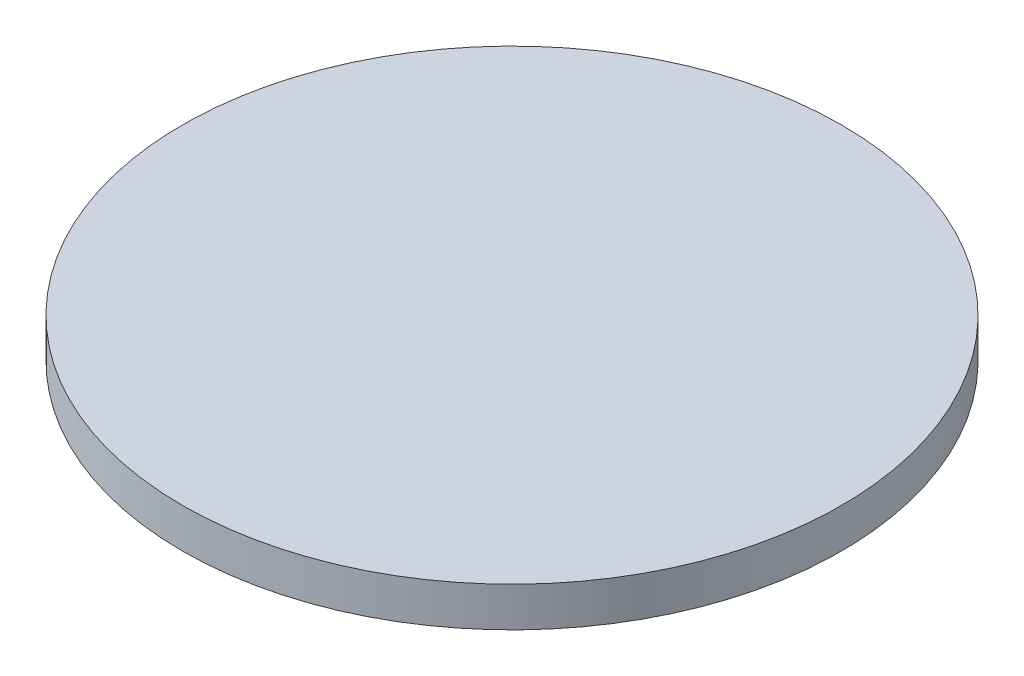
ISO-10303-21;
HEADER;
FILE_DESCRIPTION(('STEP AP214'),'2;1');
FILE_NAME('part.step','',(''),(''),'','','');
FILE_SCHEMA(('AUTOMOTIVE_DESIGN { 1 0 10303 214 1 1 1 1 }'));
ENDSEC;
DATA;
#1=APPLICATION_CONTEXT('core data for automotive mechanical design processes');
#2=APPLICATION_PROTOCOL_DEFINITION('international standard','automotive_design',2000,#1);
#3=PRODUCT_CONTEXT('',#1,'mechanical');
#4=PRODUCT('Part','Part','',(#3));
#5=PRODUCT_RELATED_PRODUCT_CATEGORY('part','',(#4));
#6=PRODUCT_DEFINITION_FORMATION('','',#4);
#7=PRODUCT_DEFINITION_CONTEXT('part definition',#1,'design');
#8=PRODUCT_DEFINITION('design','',#6,#7);
#9=PRODUCT_DEFINITION_SHAPE('','',#8);
#10=(LENGTH_UNIT() NAMED_UNIT(*) SI_UNIT(.MILLI.,.METRE.));
#11=(NAMED_UNIT(*) PLANE_ANGLE_UNIT() SI_UNIT($,.RADIAN.));
#12=(NAMED_UNIT(*) SI_UNIT($,.STERADIAN.) SOLID_ANGLE_UNIT());
#13=UNCERTAINTY_MEASURE_WITH_UNIT(LENGTH_MEASURE(1.E-05),#10,'distance_accuracy_value','');
#14=(GEOMETRIC_REPRESENTATION_CONTEXT(3) GLOBAL_UNCERTAINTY_ASSIGNED_CONTEXT((#13)) GLOBAL_UNIT_ASSIGNED_CONTEXT((#10,
#11,#12)) REPRESENTATION_CONTEXT('',''));
#15=CARTESIAN_POINT('',(0.,0.,0.));
#16=DIRECTION('',(0.,0.,1.));
#17=DIRECTION('',(1.,0.,0.));
#18=AXIS2_PLACEMENT_3D('',#15,#16,#17);
#19=CARTESIAN_POINT('',(0.,3.,0.));
#20=DIRECTION('',(0.,-1.,0.));
#21=DIRECTION('',(0.,0.,-1.));
#22=AXIS2_PLACEMENT_3D('',#19,#20,#21);
#23=CYLINDRICAL_SURFACE('',#22,25.);
#24=CARTESIAN_POINT('',(0.,3.,0.));
#25=DIRECTION('',(0.,1.,0.));
#26=DIRECTION('',(0.,0.,1.));
#27=AXIS2_PLACEMENT_3D('',#24,#25,#26);
#28=CIRCLE('',#27,25.);
#29=CARTESIAN_POINT('',(0.,3.,25.));
#30=VERTEX_POINT('',#29);
#31=EDGE_CURVE('E10',#30,#30,#28,.T.);
#32=ORIENTED_EDGE('',*,*,#31,.F.);
#33=EDGE_LOOP('',(#32));
#34=FACE_BOUND('',#33,.T.);
#35=CARTESIAN_POINT('',(0.,0.,0.));
#36=DIRECTION('',(0.,1.,0.));
#37=DIRECTION('',(0.,0.,1.));
#38=AXIS2_PLACEMENT_3D('',#35,#36,#37);
#39=CIRCLE('',#38,25.);
#40=CARTESIAN_POINT('',(0.,0.,25.));
#41=VERTEX_POINT('',#40);
#42=EDGE_CURVE('E38',#41,#41,#39,.T.);
#43=ORIENTED_EDGE('',*,*,#42,.T.);
#44=EDGE_LOOP('',(#43));
#45=FACE_BOUND('',#44,.T.);
#46=ADVANCED_FACE('F35',(#34,#45),#23,.T.);
#47=CARTESIAN_POINT('',(0.,3.,0.));
#48=DIRECTION('',(0.,1.,0.));
#49=DIRECTION('',(0.,0.,1.));
#50=AXIS2_PLACEMENT_3D('',#47,#48,#49);
#51=PLANE('',#50);
#52=ORIENTED_EDGE('',*,*,#31,.T.);
#53=EDGE_LOOP('',(#52));
#54=FACE_BOUND('',#53,.T.);
#55=ADVANCED_FACE('F50',(#54),#51,.T.);
#56=CARTESIAN_POINT('',(0.,0.,0.));
#57=DIRECTION('',(0.,1.,0.));
#58=DIRECTION('',(0.,0.,1.));
#59=AXIS2_PLACEMENT_3D('',#56,#57,#58);
#60=PLANE('',#59);
#61=ORIENTED_EDGE('',*,*,#42,.F.);
#62=EDGE_LOOP('',(#61));
#63=FACE_BOUND('',#62,.T.);
#64=ADVANCED_FACE('F48',(#63),#60,.F.);
#65=CLOSED_SHELL('',(#46,#55,#64));
#66=MANIFOLD_SOLID_BREP('B2',#65);
#67=ADVANCED_BREP_SHAPE_REPRESENTATION('',(#18,#66),#14);
#68=SHAPE_DEFINITION_REPRESENTATION(#9,#67);
ENDSEC;
END-ISO-10303-21;
